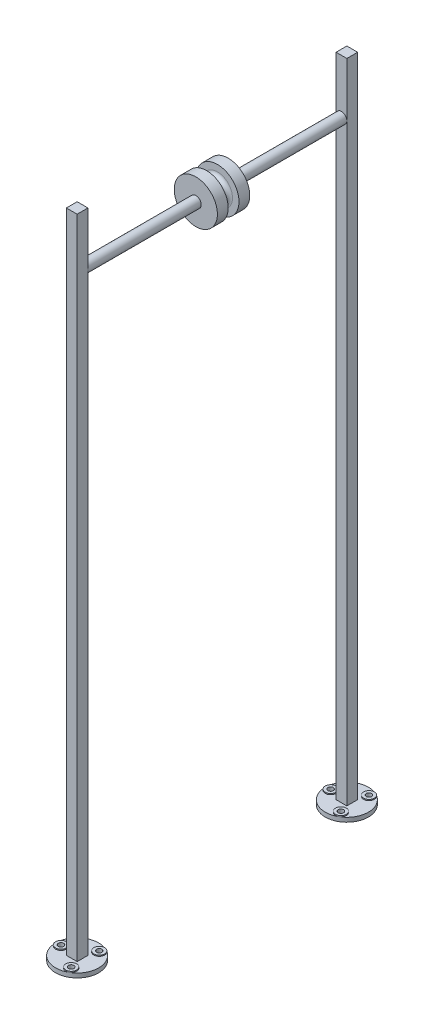
ISO-10303-21;
HEADER;
FILE_DESCRIPTION(('STEP AP214'),'2;1');
FILE_NAME('part.step','',(''),(''),'','','');
FILE_SCHEMA(('AUTOMOTIVE_DESIGN { 1 0 10303 214 1 1 1 1 }'));
ENDSEC;
DATA;
#1=APPLICATION_CONTEXT('core data for automotive mechanical design processes');
#2=APPLICATION_PROTOCOL_DEFINITION('international standard','automotive_design',2000,#1);
#3=PRODUCT_CONTEXT('',#1,'mechanical');
#4=PRODUCT('Part','Part','',(#3));
#5=PRODUCT_RELATED_PRODUCT_CATEGORY('part','',(#4));
#6=PRODUCT_DEFINITION_FORMATION('','',#4);
#7=PRODUCT_DEFINITION_CONTEXT('part definition',#1,'design');
#8=PRODUCT_DEFINITION('design','',#6,#7);
#9=PRODUCT_DEFINITION_SHAPE('','',#8);
#10=(LENGTH_UNIT() NAMED_UNIT(*) SI_UNIT(.MILLI.,.METRE.));
#11=(NAMED_UNIT(*) PLANE_ANGLE_UNIT() SI_UNIT($,.RADIAN.));
#12=(NAMED_UNIT(*) SI_UNIT($,.STERADIAN.) SOLID_ANGLE_UNIT());
#13=UNCERTAINTY_MEASURE_WITH_UNIT(LENGTH_MEASURE(1.E-05),#10,'distance_accuracy_value','');
#14=(GEOMETRIC_REPRESENTATION_CONTEXT(3) GLOBAL_UNCERTAINTY_ASSIGNED_CONTEXT((#13)) GLOBAL_UNIT_ASSIGNED_CONTEXT((#10,
#11,#12)) REPRESENTATION_CONTEXT('',''));
#15=CARTESIAN_POINT('',(0.,0.,0.));
#16=DIRECTION('',(0.,0.,1.));
#17=DIRECTION('',(1.,0.,0.));
#18=AXIS2_PLACEMENT_3D('',#15,#16,#17);
#19=CARTESIAN_POINT('',(0.,10.16,-317.5));
#20=DIRECTION('',(0.,1.,0.));
#21=DIRECTION('',(0.,0.,1.));
#22=AXIS2_PLACEMENT_3D('',#19,#20,#21);
#23=PLANE('',#22);
#24=DIRECTION('',(-1.,0.,0.));
#25=VECTOR('',#24,1.);
#26=CARTESIAN_POINT('',(-12.7,10.16,-330.2));
#27=LINE('',#26,#25);
#28=CARTESIAN_POINT('',(12.7,10.16,-330.2));
#29=VERTEX_POINT('',#28);
#30=CARTESIAN_POINT('',(-12.7,10.16,-330.2));
#31=VERTEX_POINT('',#30);
#32=EDGE_CURVE('E173',#29,#31,#27,.T.);
#33=ORIENTED_EDGE('',*,*,#32,.F.);
#34=DIRECTION('',(0.,0.,-1.));
#35=VECTOR('',#34,1.);
#36=CARTESIAN_POINT('',(12.7,10.16,-330.2));
#37=LINE('',#36,#35);
#38=CARTESIAN_POINT('',(12.7,10.16,-304.8));
#39=VERTEX_POINT('',#38);
#40=EDGE_CURVE('E159',#39,#29,#37,.T.);
#41=ORIENTED_EDGE('',*,*,#40,.F.);
#42=DIRECTION('',(1.,0.,0.));
#43=VECTOR('',#42,1.);
#44=CARTESIAN_POINT('',(-12.7,10.16,-304.8));
#45=LINE('',#44,#43);
#46=CARTESIAN_POINT('',(-12.7,10.16,-304.8));
#47=VERTEX_POINT('',#46);
#48=EDGE_CURVE('E164',#47,#39,#45,.T.);
#49=ORIENTED_EDGE('',*,*,#48,.F.);
#50=DIRECTION('',(0.,0.,1.));
#51=VECTOR('',#50,1.);
#52=CARTESIAN_POINT('',(-12.7,10.16,-330.2));
#53=LINE('',#52,#51);
#54=EDGE_CURVE('E175',#31,#47,#53,.T.);
#55=ORIENTED_EDGE('',*,*,#54,.F.);
#56=EDGE_LOOP('',(#33,#41,#49,#55));
#57=FACE_BOUND('',#56,.T.);
#58=CARTESIAN_POINT('',(0.,10.16,-317.5));
#59=DIRECTION('',(0.,1.,0.));
#60=DIRECTION('',(0.,0.,1.));
#61=AXIS2_PLACEMENT_3D('',#58,#59,#60);
#62=CIRCLE('',#61,50.8);
#63=CARTESIAN_POINT('',(25.4000000000002,10.16,-361.494090512249));
#64=VERTEX_POINT('',#63);
#65=CARTESIAN_POINT('',(-50.8,10.16,-317.5));
#66=VERTEX_POINT('',#65);
#67=EDGE_CURVE('E42',#64,#66,#62,.T.);
#68=ORIENTED_EDGE('',*,*,#67,.T.);
#69=CARTESIAN_POINT('',(-38.1,10.16,-317.5));
#70=DIRECTION('',(0.,1.,0.));
#71=DIRECTION('',(0.,0.,1.));
#72=AXIS2_PLACEMENT_3D('',#69,#70,#71);
#73=CIRCLE('',#72,12.7);
#74=EDGE_CURVE('E47',#66,#66,#73,.T.);
#75=ORIENTED_EDGE('',*,*,#74,.F.);
#76=CARTESIAN_POINT('',(25.3999999999996,10.16,-273.50590948775));
#77=VERTEX_POINT('',#76);
#78=EDGE_CURVE('E53',#66,#77,#62,.T.);
#79=ORIENTED_EDGE('',*,*,#78,.T.);
#80=CARTESIAN_POINT('',(19.0499999999997,10.16,-284.504432115813));
#81=DIRECTION('',(0.,1.,0.));
#82=DIRECTION('',(0.,0.,1.));
#83=AXIS2_PLACEMENT_3D('',#80,#81,#82);
#84=CIRCLE('',#83,12.7000000000001);
#85=EDGE_CURVE('E212',#77,#77,#84,.T.);
#86=ORIENTED_EDGE('',*,*,#85,.F.);
#87=EDGE_CURVE('E203',#77,#64,#62,.T.);
#88=ORIENTED_EDGE('',*,*,#87,.T.);
#89=CARTESIAN_POINT('',(19.0500000000001,10.16,-350.495567884187));
#90=DIRECTION('',(0.,1.,0.));
#91=DIRECTION('',(0.,0.,1.));
#92=AXIS2_PLACEMENT_3D('',#89,#90,#91);
#93=CIRCLE('',#92,12.7);
#94=EDGE_CURVE('E210',#64,#64,#93,.T.);
#95=ORIENTED_EDGE('',*,*,#94,.F.);
#96=EDGE_LOOP('',(#68,#75,#79,#86,#88,#95));
#97=FACE_BOUND('',#96,.T.);
#98=ADVANCED_FACE('F34',(#57,#97),#23,.T.);
#99=CARTESIAN_POINT('',(0.,10.16,317.5));
#100=DIRECTION('',(0.,-1.,0.));
#101=DIRECTION('',(0.,0.,-1.));
#102=AXIS2_PLACEMENT_3D('',#99,#100,#101);
#103=PLANE('',#102);
#104=DIRECTION('',(0.,0.,-1.));
#105=VECTOR('',#104,1.);
#106=CARTESIAN_POINT('',(12.7,10.16,304.8));
#107=LINE('',#106,#105);
#108=CARTESIAN_POINT('',(12.7,10.16,330.2));
#109=VERTEX_POINT('',#108);
#110=CARTESIAN_POINT('',(12.7,10.16,304.8));
#111=VERTEX_POINT('',#110);
#112=EDGE_CURVE('E278',#109,#111,#107,.T.);
#113=ORIENTED_EDGE('',*,*,#112,.F.);
#114=DIRECTION('',(1.,0.,0.));
#115=VECTOR('',#114,1.);
#116=CARTESIAN_POINT('',(-12.7,10.16,330.2));
#117=LINE('',#116,#115);
#118=CARTESIAN_POINT('',(-12.7,10.16,330.2));
#119=VERTEX_POINT('',#118);
#120=EDGE_CURVE('E283',#119,#109,#117,.T.);
#121=ORIENTED_EDGE('',*,*,#120,.F.);
#122=DIRECTION('',(0.,0.,1.));
#123=VECTOR('',#122,1.);
#124=CARTESIAN_POINT('',(-12.7,10.16,304.8));
#125=LINE('',#124,#123);
#126=CARTESIAN_POINT('',(-12.7,10.16,304.8));
#127=VERTEX_POINT('',#126);
#128=EDGE_CURVE('E295',#127,#119,#125,.T.);
#129=ORIENTED_EDGE('',*,*,#128,.F.);
#130=DIRECTION('',(-1.,0.,0.));
#131=VECTOR('',#130,1.);
#132=CARTESIAN_POINT('',(-12.7,10.16,304.8));
#133=LINE('',#132,#131);
#134=EDGE_CURVE('E292',#111,#127,#133,.T.);
#135=ORIENTED_EDGE('',*,*,#134,.F.);
#136=EDGE_LOOP('',(#113,#121,#129,#135));
#137=FACE_BOUND('',#136,.T.);
#138=CARTESIAN_POINT('',(0.,10.16,317.5));
#139=DIRECTION('',(0.,1.,0.));
#140=DIRECTION('',(0.,0.,-1.));
#141=AXIS2_PLACEMENT_3D('',#138,#139,#140);
#142=CIRCLE('',#141,50.8);
#143=CARTESIAN_POINT('',(-50.8,10.16,317.5));
#144=VERTEX_POINT('',#143);
#145=CARTESIAN_POINT('',(25.4000000000002,10.16,361.494090512249));
#146=VERTEX_POINT('',#145);
#147=EDGE_CURVE('E130',#144,#146,#142,.T.);
#148=ORIENTED_EDGE('',*,*,#147,.T.);
#149=CARTESIAN_POINT('',(19.0500000000001,10.16,350.495567884187));
#150=DIRECTION('',(0.,1.,0.));
#151=DIRECTION('',(0.,0.,1.));
#152=AXIS2_PLACEMENT_3D('',#149,#150,#151);
#153=CIRCLE('',#152,12.7);
#154=EDGE_CURVE('E134',#146,#146,#153,.T.);
#155=ORIENTED_EDGE('',*,*,#154,.F.);
#156=CARTESIAN_POINT('',(25.3999999999996,10.16,273.50590948775));
#157=VERTEX_POINT('',#156);
#158=EDGE_CURVE('E140',#146,#157,#142,.T.);
#159=ORIENTED_EDGE('',*,*,#158,.T.);
#160=CARTESIAN_POINT('',(19.0499999999997,10.16,284.504432115813));
#161=DIRECTION('',(0.,1.,0.));
#162=DIRECTION('',(0.,0.,1.));
#163=AXIS2_PLACEMENT_3D('',#160,#161,#162);
#164=CIRCLE('',#163,12.7);
#165=EDGE_CURVE('E235',#157,#157,#164,.T.);
#166=ORIENTED_EDGE('',*,*,#165,.F.);
#167=EDGE_CURVE('E142',#157,#144,#142,.T.);
#168=ORIENTED_EDGE('',*,*,#167,.T.);
#169=CARTESIAN_POINT('',(-38.1,10.16,317.5));
#170=DIRECTION('',(0.,1.,0.));
#171=DIRECTION('',(0.,0.,1.));
#172=AXIS2_PLACEMENT_3D('',#169,#170,#171);
#173=CIRCLE('',#172,12.7);
#174=EDGE_CURVE('E136',#144,#144,#173,.T.);
#175=ORIENTED_EDGE('',*,*,#174,.F.);
#176=EDGE_LOOP('',(#148,#155,#159,#166,#168,#175));
#177=FACE_BOUND('',#176,.T.);
#178=ADVANCED_FACE('F132',(#137,#177),#103,.F.);
#179=CARTESIAN_POINT('',(0.,1407.16,304.8));
#180=DIRECTION('',(0.,0.,-1.));
#181=DIRECTION('',(-1.,0.,0.));
#182=AXIS2_PLACEMENT_3D('',#179,#180,#181);
#183=CYLINDRICAL_SURFACE('',#182,12.7);
#184=CARTESIAN_POINT('',(0.,1407.16,304.8));
#185=DIRECTION('',(0.,0.,-1.));
#186=DIRECTION('',(-1.,0.,0.));
#187=AXIS2_PLACEMENT_3D('',#184,#185,#186);
#188=CIRCLE('',#187,12.7);
#189=CARTESIAN_POINT('',(-12.7,1407.16,304.8));
#190=VERTEX_POINT('',#189);
#191=CARTESIAN_POINT('',(12.7,1407.16,304.8));
#192=VERTEX_POINT('',#191);
#193=EDGE_CURVE('E153',#190,#192,#188,.T.);
#194=ORIENTED_EDGE('',*,*,#193,.T.);
#195=EDGE_CURVE('E139',#192,#190,#188,.T.);
#196=ORIENTED_EDGE('',*,*,#195,.T.);
#197=EDGE_LOOP('',(#194,#196));
#198=FACE_BOUND('',#197,.T.);
#199=CARTESIAN_POINT('',(0.,1407.16,38.1));
#200=DIRECTION('',(0.,0.,1.));
#201=DIRECTION('',(1.,0.,0.));
#202=AXIS2_PLACEMENT_3D('',#199,#200,#201);
#203=CIRCLE('',#202,12.6999999999999);
#204=CARTESIAN_POINT('',(12.6999999999999,1407.16,38.1));
#205=VERTEX_POINT('',#204);
#206=EDGE_CURVE('E275',#205,#205,#203,.T.);
#207=ORIENTED_EDGE('',*,*,#206,.T.);
#208=EDGE_LOOP('',(#207));
#209=FACE_BOUND('',#208,.T.);
#210=ADVANCED_FACE('F354',(#198,#209),#183,.T.);
#211=CARTESIAN_POINT('',(-12.7,1534.16,304.8));
#212=DIRECTION('',(0.,0.,1.));
#213=DIRECTION('',(1.,0.,0.));
#214=AXIS2_PLACEMENT_3D('',#211,#212,#213);
#215=PLANE('',#214);
#216=ORIENTED_EDGE('',*,*,#195,.F.);
#217=DIRECTION('',(0.,-1.,0.));
#218=VECTOR('',#217,1.);
#219=CARTESIAN_POINT('',(12.7,1534.16,304.8));
#220=LINE('',#219,#218);
#221=EDGE_CURVE('E309',#192,#111,#220,.T.);
#222=ORIENTED_EDGE('',*,*,#221,.T.);
#223=ORIENTED_EDGE('',*,*,#134,.T.);
#224=DIRECTION('',(0.,-1.,0.));
#225=VECTOR('',#224,1.);
#226=CARTESIAN_POINT('',(-12.7,1534.16,304.8));
#227=LINE('',#226,#225);
#228=EDGE_CURVE('E305',#190,#127,#227,.T.);
#229=ORIENTED_EDGE('',*,*,#228,.F.);
#230=EDGE_LOOP('',(#216,#222,#223,#229));
#231=FACE_BOUND('',#230,.T.);
#232=ADVANCED_FACE('F446',(#231),#215,.F.);
#233=CARTESIAN_POINT('',(0.,0.,317.5));
#234=DIRECTION('',(0.,-1.,0.));
#235=DIRECTION('',(0.,0.,-1.));
#236=AXIS2_PLACEMENT_3D('',#233,#234,#235);
#237=PLANE('',#236);
#238=CARTESIAN_POINT('',(19.0500000000001,0.,350.495567884187));
#239=DIRECTION('',(0.,1.,0.));
#240=DIRECTION('',(0.,0.,-1.));
#241=AXIS2_PLACEMENT_3D('',#238,#239,#240);
#242=CIRCLE('',#241,6.35);
#243=CARTESIAN_POINT('',(19.0500000000001,0.,344.145567884187));
#244=VERTEX_POINT('',#243);
#245=EDGE_CURVE('E314',#244,#244,#242,.T.);
#246=ORIENTED_EDGE('',*,*,#245,.T.);
#247=EDGE_LOOP('',(#246));
#248=FACE_BOUND('',#247,.T.);
#249=CARTESIAN_POINT('',(0.,0.,317.5));
#250=DIRECTION('',(0.,1.,0.));
#251=DIRECTION('',(0.,0.,-1.));
#252=AXIS2_PLACEMENT_3D('',#249,#250,#251);
#253=CIRCLE('',#252,50.8);
#254=CARTESIAN_POINT('',(0.,0.,266.7));
#255=VERTEX_POINT('',#254);
#256=EDGE_CURVE('E146',#255,#255,#253,.T.);
#257=ORIENTED_EDGE('',*,*,#256,.F.);
#258=EDGE_LOOP('',(#257));
#259=FACE_BOUND('',#258,.T.);
#260=CARTESIAN_POINT('',(19.0499999999997,0.,284.504432115813));
#261=DIRECTION('',(0.,1.,0.));
#262=DIRECTION('',(0.,0.,-1.));
#263=AXIS2_PLACEMENT_3D('',#260,#261,#262);
#264=CIRCLE('',#263,6.35000000000002);
#265=CARTESIAN_POINT('',(19.0499999999997,0.,278.154432115813));
#266=VERTEX_POINT('',#265);
#267=EDGE_CURVE('E149',#266,#266,#264,.T.);
#268=ORIENTED_EDGE('',*,*,#267,.T.);
#269=EDGE_LOOP('',(#268));
#270=FACE_BOUND('',#269,.T.);
#271=CARTESIAN_POINT('',(-38.1,0.,317.5));
#272=DIRECTION('',(0.,1.,0.));
#273=DIRECTION('',(0.,0.,-1.));
#274=AXIS2_PLACEMENT_3D('',#271,#272,#273);
#275=CIRCLE('',#274,6.35);
#276=CARTESIAN_POINT('',(-38.1,0.,311.15));
#277=VERTEX_POINT('',#276);
#278=EDGE_CURVE('E312',#277,#277,#275,.T.);
#279=ORIENTED_EDGE('',*,*,#278,.T.);
#280=EDGE_LOOP('',(#279));
#281=FACE_BOUND('',#280,.T.);
#282=ADVANCED_FACE('F321',(#248,#259,#270,#281),#237,.T.);
#283=CARTESIAN_POINT('',(0.,10.16,317.5));
#284=DIRECTION('',(0.,-1.,0.));
#285=DIRECTION('',(0.,0.,-1.));
#286=AXIS2_PLACEMENT_3D('',#283,#284,#285);
#287=CYLINDRICAL_SURFACE('',#286,50.8);
#288=ORIENTED_EDGE('',*,*,#147,.F.);
#289=ORIENTED_EDGE('',*,*,#167,.F.);
#290=ORIENTED_EDGE('',*,*,#158,.F.);
#291=EDGE_LOOP('',(#288,#289,#290));
#292=FACE_BOUND('',#291,.T.);
#293=ORIENTED_EDGE('',*,*,#256,.T.);
#294=EDGE_LOOP('',(#293));
#295=FACE_BOUND('',#294,.T.);
#296=ADVANCED_FACE('F143',(#292,#295),#287,.T.);
#297=CARTESIAN_POINT('',(19.0499999999997,10.16,284.504432115813));
#298=DIRECTION('',(0.,-1.,0.));
#299=DIRECTION('',(0.,0.,-1.));
#300=AXIS2_PLACEMENT_3D('',#297,#298,#299);
#301=CYLINDRICAL_SURFACE('',#300,6.35000000000002);
#302=ORIENTED_EDGE('',*,*,#267,.F.);
#303=EDGE_LOOP('',(#302));
#304=FACE_BOUND('',#303,.T.);
#305=CARTESIAN_POINT('',(19.0499999999997,12.7,284.504432115813));
#306=DIRECTION('',(0.,1.,0.));
#307=DIRECTION('',(0.,0.,1.));
#308=AXIS2_PLACEMENT_3D('',#305,#306,#307);
#309=CIRCLE('',#308,6.35000000000001);
#310=CARTESIAN_POINT('',(19.0499999999997,12.7,290.854432115813));
#311=VERTEX_POINT('',#310);
#312=EDGE_CURVE('E231',#311,#311,#309,.T.);
#313=ORIENTED_EDGE('',*,*,#312,.T.);
#314=EDGE_LOOP('',(#313));
#315=FACE_BOUND('',#314,.T.);
#316=ADVANCED_FACE('F324',(#304,#315),#301,.F.);
#317=CARTESIAN_POINT('',(19.0500000000001,10.16,350.495567884187));
#318=DIRECTION('',(0.,-1.,0.));
#319=DIRECTION('',(0.,0.,-1.));
#320=AXIS2_PLACEMENT_3D('',#317,#318,#319);
#321=CYLINDRICAL_SURFACE('',#320,6.35);
#322=ORIENTED_EDGE('',*,*,#245,.F.);
#323=EDGE_LOOP('',(#322));
#324=FACE_BOUND('',#323,.T.);
#325=CARTESIAN_POINT('',(19.0500000000001,12.7,350.495567884187));
#326=DIRECTION('',(0.,1.,0.));
#327=DIRECTION('',(0.,0.,1.));
#328=AXIS2_PLACEMENT_3D('',#325,#326,#327);
#329=CIRCLE('',#328,6.35000000000001);
#330=CARTESIAN_POINT('',(19.0500000000001,12.7,356.845567884187));
#331=VERTEX_POINT('',#330);
#332=EDGE_CURVE('E220',#331,#331,#329,.T.);
#333=ORIENTED_EDGE('',*,*,#332,.T.);
#334=EDGE_LOOP('',(#333));
#335=FACE_BOUND('',#334,.T.);
#336=ADVANCED_FACE('F327',(#324,#335),#321,.F.);
#337=CARTESIAN_POINT('',(-38.1,10.16,317.5));
#338=DIRECTION('',(0.,-1.,0.));
#339=DIRECTION('',(0.,0.,-1.));
#340=AXIS2_PLACEMENT_3D('',#337,#338,#339);
#341=CYLINDRICAL_SURFACE('',#340,6.35);
#342=ORIENTED_EDGE('',*,*,#278,.F.);
#343=EDGE_LOOP('',(#342));
#344=FACE_BOUND('',#343,.T.);
#345=CARTESIAN_POINT('',(-38.1,12.7,317.5));
#346=DIRECTION('',(0.,1.,0.));
#347=DIRECTION('',(0.,0.,1.));
#348=AXIS2_PLACEMENT_3D('',#345,#346,#347);
#349=CIRCLE('',#348,6.35000000000002);
#350=CARTESIAN_POINT('',(-38.1,12.7,323.85));
#351=VERTEX_POINT('',#350);
#352=EDGE_CURVE('E239',#351,#351,#349,.T.);
#353=ORIENTED_EDGE('',*,*,#352,.T.);
#354=EDGE_LOOP('',(#353));
#355=FACE_BOUND('',#354,.T.);
#356=ADVANCED_FACE('F433',(#344,#355),#341,.F.);
#357=CARTESIAN_POINT('',(12.7,1534.16,304.8));
#358=DIRECTION('',(-1.,0.,0.));
#359=DIRECTION('',(0.,0.,1.));
#360=AXIS2_PLACEMENT_3D('',#357,#358,#359);
#361=PLANE('',#360);
#362=ORIENTED_EDGE('',*,*,#112,.T.);
#363=ORIENTED_EDGE('',*,*,#221,.F.);
#364=CARTESIAN_POINT('',(12.7,1534.16,304.8));
#365=VERTEX_POINT('',#364);
#366=EDGE_CURVE('E310',#365,#192,#220,.T.);
#367=ORIENTED_EDGE('',*,*,#366,.F.);
#368=DIRECTION('',(0.,0.,-1.));
#369=VECTOR('',#368,1.);
#370=CARTESIAN_POINT('',(12.7,1534.16,304.8));
#371=LINE('',#370,#369);
#372=CARTESIAN_POINT('',(12.7,1534.16,330.2));
#373=VERTEX_POINT('',#372);
#374=EDGE_CURVE('E279',#373,#365,#371,.T.);
#375=ORIENTED_EDGE('',*,*,#374,.F.);
#376=DIRECTION('',(0.,-1.,0.));
#377=VECTOR('',#376,1.);
#378=CARTESIAN_POINT('',(12.7,1534.16,330.2));
#379=LINE('',#378,#377);
#380=EDGE_CURVE('E289',#373,#109,#379,.T.);
#381=ORIENTED_EDGE('',*,*,#380,.T.);
#382=EDGE_LOOP('',(#362,#363,#367,#375,#381));
#383=FACE_BOUND('',#382,.T.);
#384=ADVANCED_FACE('F439',(#383),#361,.F.);
#385=ORIENTED_EDGE('',*,*,#193,.F.);
#386=CARTESIAN_POINT('',(-12.7,1534.16,304.8));
#387=VERTEX_POINT('',#386);
#388=EDGE_CURVE('E306',#387,#190,#227,.T.);
#389=ORIENTED_EDGE('',*,*,#388,.F.);
#390=DIRECTION('',(-1.,0.,0.));
#391=VECTOR('',#390,1.);
#392=CARTESIAN_POINT('',(-12.7,1534.16,304.8));
#393=LINE('',#392,#391);
#394=EDGE_CURVE('E282',#365,#387,#393,.T.);
#395=ORIENTED_EDGE('',*,*,#394,.F.);
#396=ORIENTED_EDGE('',*,*,#366,.T.);
#397=EDGE_LOOP('',(#385,#389,#395,#396));
#398=FACE_BOUND('',#397,.T.);
#399=ADVANCED_FACE('F668',(#398),#215,.F.);
#400=CARTESIAN_POINT('',(-12.7,1534.16,304.8));
#401=DIRECTION('',(1.,0.,0.));
#402=DIRECTION('',(0.,0.,-1.));
#403=AXIS2_PLACEMENT_3D('',#400,#401,#402);
#404=PLANE('',#403);
#405=ORIENTED_EDGE('',*,*,#128,.T.);
#406=DIRECTION('',(0.,-1.,0.));
#407=VECTOR('',#406,1.);
#408=CARTESIAN_POINT('',(-12.7,1534.16,330.2));
#409=LINE('',#408,#407);
#410=CARTESIAN_POINT('',(-12.7,1534.16,330.2));
#411=VERTEX_POINT('',#410);
#412=EDGE_CURVE('E302',#411,#119,#409,.T.);
#413=ORIENTED_EDGE('',*,*,#412,.F.);
#414=DIRECTION('',(0.,0.,1.));
#415=VECTOR('',#414,1.);
#416=CARTESIAN_POINT('',(-12.7,1534.16,304.8));
#417=LINE('',#416,#415);
#418=EDGE_CURVE('E285',#387,#411,#417,.T.);
#419=ORIENTED_EDGE('',*,*,#418,.F.);
#420=ORIENTED_EDGE('',*,*,#388,.T.);
#421=ORIENTED_EDGE('',*,*,#228,.T.);
#422=EDGE_LOOP('',(#405,#413,#419,#420,#421));
#423=FACE_BOUND('',#422,.T.);
#424=ADVANCED_FACE('F658',(#423),#404,.F.);
#425=CARTESIAN_POINT('',(-12.7,1534.16,330.2));
#426=DIRECTION('',(0.,0.,-1.));
#427=DIRECTION('',(-1.,0.,0.));
#428=AXIS2_PLACEMENT_3D('',#425,#426,#427);
#429=PLANE('',#428);
#430=ORIENTED_EDGE('',*,*,#120,.T.);
#431=ORIENTED_EDGE('',*,*,#380,.F.);
#432=DIRECTION('',(1.,0.,0.));
#433=VECTOR('',#432,1.);
#434=CARTESIAN_POINT('',(-12.7,1534.16,330.2));
#435=LINE('',#434,#433);
#436=EDGE_CURVE('E287',#411,#373,#435,.T.);
#437=ORIENTED_EDGE('',*,*,#436,.F.);
#438=ORIENTED_EDGE('',*,*,#412,.T.);
#439=EDGE_LOOP('',(#430,#431,#437,#438));
#440=FACE_BOUND('',#439,.T.);
#441=ADVANCED_FACE('F648',(#440),#429,.F.);
#442=CARTESIAN_POINT('',(0.,1534.16,0.));
#443=DIRECTION('',(0.,1.,0.));
#444=DIRECTION('',(0.,0.,1.));
#445=AXIS2_PLACEMENT_3D('',#442,#443,#444);
#446=PLANE('',#445);
#447=ORIENTED_EDGE('',*,*,#374,.T.);
#448=ORIENTED_EDGE('',*,*,#394,.T.);
#449=ORIENTED_EDGE('',*,*,#418,.T.);
#450=ORIENTED_EDGE('',*,*,#436,.T.);
#451=EDGE_LOOP('',(#447,#448,#449,#450));
#452=FACE_BOUND('',#451,.T.);
#453=ADVANCED_FACE('F633',(#452),#446,.T.);
#454=CARTESIAN_POINT('',(0.,1419.86,38.1));
#455=DIRECTION('',(0.,0.,-1.));
#456=DIRECTION('',(-1.,0.,0.));
#457=AXIS2_PLACEMENT_3D('',#454,#455,#456);
#458=PLANE('',#457);
#459=ORIENTED_EDGE('',*,*,#206,.F.);
#460=EDGE_LOOP('',(#459));
#461=FACE_BOUND('',#460,.T.);
#462=CARTESIAN_POINT('',(0.,1407.16,38.1));
#463=DIRECTION('',(0.,0.,1.));
#464=DIRECTION('',(1.,0.,0.));
#465=AXIS2_PLACEMENT_3D('',#462,#463,#464);
#466=CIRCLE('',#465,50.8);
#467=CARTESIAN_POINT('',(50.8,1407.16,38.1));
#468=VERTEX_POINT('',#467);
#469=EDGE_CURVE('E272',#468,#468,#466,.T.);
#470=ORIENTED_EDGE('',*,*,#469,.T.);
#471=EDGE_LOOP('',(#470));
#472=FACE_BOUND('',#471,.T.);
#473=ADVANCED_FACE('F623',(#461,#472),#458,.F.);
#474=CARTESIAN_POINT('',(0.,1407.16,304.8));
#475=DIRECTION('',(0.,0.,1.));
#476=DIRECTION('',(1.,0.,0.));
#477=AXIS2_PLACEMENT_3D('',#474,#475,#476);
#478=CYLINDRICAL_SURFACE('',#477,50.8);
#479=ORIENTED_EDGE('',*,*,#469,.F.);
#480=EDGE_LOOP('',(#479));
#481=FACE_BOUND('',#480,.T.);
#482=CARTESIAN_POINT('',(0.,1407.16,12.7));
#483=DIRECTION('',(0.,0.,1.));
#484=DIRECTION('',(1.,0.,0.));
#485=AXIS2_PLACEMENT_3D('',#482,#483,#484);
#486=CIRCLE('',#485,50.8);
#487=CARTESIAN_POINT('',(50.8,1407.16,12.7));
#488=VERTEX_POINT('',#487);
#489=EDGE_CURVE('E269',#488,#488,#486,.T.);
#490=ORIENTED_EDGE('',*,*,#489,.T.);
#491=EDGE_LOOP('',(#490));
#492=FACE_BOUND('',#491,.T.);
#493=ADVANCED_FACE('F613',(#481,#492),#478,.T.);
#494=CARTESIAN_POINT('',(0.,1457.96,12.7));
#495=DIRECTION('',(0.,0.,1.));
#496=DIRECTION('',(1.,0.,0.));
#497=AXIS2_PLACEMENT_3D('',#494,#495,#496);
#498=PLANE('',#497);
#499=ORIENTED_EDGE('',*,*,#489,.F.);
#500=EDGE_LOOP('',(#499));
#501=FACE_BOUND('',#500,.T.);
#502=CARTESIAN_POINT('',(0.,1407.16,12.7));
#503=DIRECTION('',(0.,0.,1.));
#504=DIRECTION('',(1.,0.,0.));
#505=AXIS2_PLACEMENT_3D('',#502,#503,#504);
#506=CIRCLE('',#505,35.5599999999998);
#507=CARTESIAN_POINT('',(35.5599999999998,1407.16,12.7));
#508=VERTEX_POINT('',#507);
#509=EDGE_CURVE('E266',#508,#508,#506,.T.);
#510=ORIENTED_EDGE('',*,*,#509,.T.);
#511=EDGE_LOOP('',(#510));
#512=FACE_BOUND('',#511,.T.);
#513=ADVANCED_FACE('F603',(#501,#512),#498,.F.);
#514=CARTESIAN_POINT('',(0.,1407.16,2.53999999999999));
#515=DIRECTION('',(0.,0.,1.));
#516=DIRECTION('',(1.,0.,0.));
#517=AXIS2_PLACEMENT_3D('',#514,#515,#516);
#518=TOROIDAL_SURFACE('',#517,35.5599999999998,10.16);
#519=ORIENTED_EDGE('',*,*,#509,.F.);
#520=EDGE_LOOP('',(#519));
#521=FACE_BOUND('',#520,.T.);
#522=CARTESIAN_POINT('',(0.,1407.16,2.53999999999999));
#523=DIRECTION('',(0.,0.,1.));
#524=DIRECTION('',(1.,0.,0.));
#525=AXIS2_PLACEMENT_3D('',#522,#523,#524);
#526=CIRCLE('',#525,25.3999999999999);
#527=CARTESIAN_POINT('',(25.3999999999999,1407.16,2.53999999999999));
#528=VERTEX_POINT('',#527);
#529=EDGE_CURVE('E263',#528,#528,#526,.T.);
#530=ORIENTED_EDGE('',*,*,#529,.T.);
#531=EDGE_LOOP('',(#530));
#532=FACE_BOUND('',#531,.T.);
#533=ADVANCED_FACE('F593',(#521,#532),#518,.F.);
#534=CARTESIAN_POINT('',(0.,1407.16,304.8));
#535=DIRECTION('',(0.,0.,1.));
#536=DIRECTION('',(1.,0.,0.));
#537=AXIS2_PLACEMENT_3D('',#534,#535,#536);
#538=CYLINDRICAL_SURFACE('',#537,25.3999999999999);
#539=ORIENTED_EDGE('',*,*,#529,.F.);
#540=EDGE_LOOP('',(#539));
#541=FACE_BOUND('',#540,.T.);
#542=CARTESIAN_POINT('',(0.,1407.16,-2.53999999999988));
#543=DIRECTION('',(0.,0.,1.));
#544=DIRECTION('',(1.,0.,0.));
#545=AXIS2_PLACEMENT_3D('',#542,#543,#544);
#546=CIRCLE('',#545,25.3999999999999);
#547=CARTESIAN_POINT('',(25.3999999999999,1407.16,-2.53999999999988));
#548=VERTEX_POINT('',#547);
#549=EDGE_CURVE('E260',#548,#548,#546,.T.);
#550=ORIENTED_EDGE('',*,*,#549,.T.);
#551=EDGE_LOOP('',(#550));
#552=FACE_BOUND('',#551,.T.);
#553=ADVANCED_FACE('F583',(#541,#552),#538,.T.);
#554=CARTESIAN_POINT('',(0.,1407.16,-2.53999999999984));
#555=DIRECTION('',(0.,0.,1.));
#556=DIRECTION('',(1.,0.,0.));
#557=AXIS2_PLACEMENT_3D('',#554,#555,#556);
#558=TOROIDAL_SURFACE('',#557,35.5599999999998,10.16);
#559=ORIENTED_EDGE('',*,*,#549,.F.);
#560=EDGE_LOOP('',(#559));
#561=FACE_BOUND('',#560,.T.);
#562=CARTESIAN_POINT('',(0.,1407.16,-12.6999999999998));
#563=DIRECTION('',(0.,0.,1.));
#564=DIRECTION('',(1.,0.,0.));
#565=AXIS2_PLACEMENT_3D('',#562,#563,#564);
#566=CIRCLE('',#565,35.5599999999998);
#567=CARTESIAN_POINT('',(35.5599999999998,1407.16,-12.6999999999998));
#568=VERTEX_POINT('',#567);
#569=EDGE_CURVE('E257',#568,#568,#566,.T.);
#570=ORIENTED_EDGE('',*,*,#569,.T.);
#571=EDGE_LOOP('',(#570));
#572=FACE_BOUND('',#571,.T.);
#573=ADVANCED_FACE('F573',(#561,#572),#558,.F.);
#574=CARTESIAN_POINT('',(0.,1457.96,-12.6999999999998));
#575=DIRECTION('',(0.,0.,-1.));
#576=DIRECTION('',(-1.,0.,0.));
#577=AXIS2_PLACEMENT_3D('',#574,#575,#576);
#578=PLANE('',#577);
#579=ORIENTED_EDGE('',*,*,#569,.F.);
#580=EDGE_LOOP('',(#579));
#581=FACE_BOUND('',#580,.T.);
#582=CARTESIAN_POINT('',(0.,1407.16,-12.6999999999998));
#583=DIRECTION('',(0.,0.,1.));
#584=DIRECTION('',(1.,0.,0.));
#585=AXIS2_PLACEMENT_3D('',#582,#583,#584);
#586=CIRCLE('',#585,50.8);
#587=CARTESIAN_POINT('',(50.8,1407.16,-12.6999999999998));
#588=VERTEX_POINT('',#587);
#589=EDGE_CURVE('E254',#588,#588,#586,.T.);
#590=ORIENTED_EDGE('',*,*,#589,.T.);
#591=EDGE_LOOP('',(#590));
#592=FACE_BOUND('',#591,.T.);
#593=ADVANCED_FACE('F563',(#581,#592),#578,.F.);
#594=CARTESIAN_POINT('',(0.,1407.16,304.8));
#595=DIRECTION('',(0.,0.,1.));
#596=DIRECTION('',(1.,0.,0.));
#597=AXIS2_PLACEMENT_3D('',#594,#595,#596);
#598=CYLINDRICAL_SURFACE('',#597,50.8);
#599=ORIENTED_EDGE('',*,*,#589,.F.);
#600=EDGE_LOOP('',(#599));
#601=FACE_BOUND('',#600,.T.);
#602=CARTESIAN_POINT('',(0.,1407.16,-38.0999999999998));
#603=DIRECTION('',(0.,0.,1.));
#604=DIRECTION('',(1.,0.,0.));
#605=AXIS2_PLACEMENT_3D('',#602,#603,#604);
#606=CIRCLE('',#605,50.8);
#607=CARTESIAN_POINT('',(50.8,1407.16,-38.0999999999998));
#608=VERTEX_POINT('',#607);
#609=EDGE_CURVE('E251',#608,#608,#606,.T.);
#610=ORIENTED_EDGE('',*,*,#609,.T.);
#611=EDGE_LOOP('',(#610));
#612=FACE_BOUND('',#611,.T.);
#613=ADVANCED_FACE('F372',(#601,#612),#598,.T.);
#614=CARTESIAN_POINT('',(0.,1419.86,-38.0999999999998));
#615=DIRECTION('',(0.,0.,1.));
#616=DIRECTION('',(1.,0.,0.));
#617=AXIS2_PLACEMENT_3D('',#614,#615,#616);
#618=PLANE('',#617);
#619=ORIENTED_EDGE('',*,*,#609,.F.);
#620=EDGE_LOOP('',(#619));
#621=FACE_BOUND('',#620,.T.);
#622=CARTESIAN_POINT('',(0.,1407.16,-38.0999999999999));
#623=DIRECTION('',(0.,0.,1.));
#624=DIRECTION('',(1.,0.,0.));
#625=AXIS2_PLACEMENT_3D('',#622,#623,#624);
#626=CIRCLE('',#625,12.6999999999999);
#627=CARTESIAN_POINT('',(12.6999999999999,1407.16,-38.0999999999999));
#628=VERTEX_POINT('',#627);
#629=EDGE_CURVE('E247',#628,#628,#626,.T.);
#630=ORIENTED_EDGE('',*,*,#629,.T.);
#631=EDGE_LOOP('',(#630));
#632=FACE_BOUND('',#631,.T.);
#633=ADVANCED_FACE('F364',(#621,#632),#618,.F.);
#634=CARTESIAN_POINT('',(0.,0.,-317.5));
#635=DIRECTION('',(0.,1.,0.));
#636=DIRECTION('',(0.,0.,1.));
#637=AXIS2_PLACEMENT_3D('',#634,#635,#636);
#638=PLANE('',#637);
#639=CARTESIAN_POINT('',(0.,0.,-317.5));
#640=DIRECTION('',(0.,1.,0.));
#641=DIRECTION('',(0.,0.,1.));
#642=AXIS2_PLACEMENT_3D('',#639,#640,#641);
#643=CIRCLE('',#642,50.8);
#644=CARTESIAN_POINT('',(0.,0.,-266.7));
#645=VERTEX_POINT('',#644);
#646=EDGE_CURVE('E201',#645,#645,#643,.T.);
#647=ORIENTED_EDGE('',*,*,#646,.F.);
#648=EDGE_LOOP('',(#647));
#649=FACE_BOUND('',#648,.T.);
#650=CARTESIAN_POINT('',(-38.1,0.,-317.5));
#651=DIRECTION('',(0.,1.,0.));
#652=DIRECTION('',(0.,0.,1.));
#653=AXIS2_PLACEMENT_3D('',#650,#651,#652);
#654=CIRCLE('',#653,6.35);
#655=CARTESIAN_POINT('',(-38.1,0.,-311.15));
#656=VERTEX_POINT('',#655);
#657=EDGE_CURVE('E198',#656,#656,#654,.T.);
#658=ORIENTED_EDGE('',*,*,#657,.T.);
#659=EDGE_LOOP('',(#658));
#660=FACE_BOUND('',#659,.T.);
#661=CARTESIAN_POINT('',(19.0500000000001,0.,-350.495567884187));
#662=DIRECTION('',(0.,1.,0.));
#663=DIRECTION('',(0.,0.,1.));
#664=AXIS2_PLACEMENT_3D('',#661,#662,#663);
#665=CIRCLE('',#664,6.35);
#666=CARTESIAN_POINT('',(19.0500000000001,0.,-344.145567884187));
#667=VERTEX_POINT('',#666);
#668=EDGE_CURVE('E195',#667,#667,#665,.T.);
#669=ORIENTED_EDGE('',*,*,#668,.T.);
#670=EDGE_LOOP('',(#669));
#671=FACE_BOUND('',#670,.T.);
#672=CARTESIAN_POINT('',(19.0499999999997,0.,-284.504432115813));
#673=DIRECTION('',(0.,1.,0.));
#674=DIRECTION('',(0.,0.,1.));
#675=AXIS2_PLACEMENT_3D('',#672,#673,#674);
#676=CIRCLE('',#675,6.35000000000002);
#677=CARTESIAN_POINT('',(19.0499999999997,0.,-278.154432115813));
#678=VERTEX_POINT('',#677);
#679=EDGE_CURVE('E192',#678,#678,#676,.T.);
#680=ORIENTED_EDGE('',*,*,#679,.T.);
#681=EDGE_LOOP('',(#680));
#682=FACE_BOUND('',#681,.T.);
#683=ADVANCED_FACE('F361',(#649,#660,#671,#682),#638,.F.);
#684=CARTESIAN_POINT('',(19.0499999999997,10.16,-284.504432115813));
#685=DIRECTION('',(0.,-1.,0.));
#686=DIRECTION('',(0.,0.,-1.));
#687=AXIS2_PLACEMENT_3D('',#684,#685,#686);
#688=CYLINDRICAL_SURFACE('',#687,6.35000000000002);
#689=ORIENTED_EDGE('',*,*,#679,.F.);
#690=EDGE_LOOP('',(#689));
#691=FACE_BOUND('',#690,.T.);
#692=CARTESIAN_POINT('',(19.0499999999997,12.7,-284.504432115813));
#693=DIRECTION('',(0.,1.,0.));
#694=DIRECTION('',(0.,0.,1.));
#695=AXIS2_PLACEMENT_3D('',#692,#693,#694);
#696=CIRCLE('',#695,6.35000000000003);
#697=CARTESIAN_POINT('',(19.0499999999997,12.7,-278.154432115813));
#698=VERTEX_POINT('',#697);
#699=EDGE_CURVE('E384',#698,#698,#696,.T.);
#700=ORIENTED_EDGE('',*,*,#699,.T.);
#701=EDGE_LOOP('',(#700));
#702=FACE_BOUND('',#701,.T.);
#703=ADVANCED_FACE('F363',(#691,#702),#688,.F.);
#704=CARTESIAN_POINT('',(-38.1,10.16,-317.5));
#705=DIRECTION('',(0.,-1.,0.));
#706=DIRECTION('',(0.,0.,-1.));
#707=AXIS2_PLACEMENT_3D('',#704,#705,#706);
#708=CYLINDRICAL_SURFACE('',#707,6.35);
#709=ORIENTED_EDGE('',*,*,#657,.F.);
#710=EDGE_LOOP('',(#709));
#711=FACE_BOUND('',#710,.T.);
#712=CARTESIAN_POINT('',(-38.1,12.7,-317.5));
#713=DIRECTION('',(0.,1.,0.));
#714=DIRECTION('',(0.,0.,1.));
#715=AXIS2_PLACEMENT_3D('',#712,#713,#714);
#716=CIRCLE('',#715,6.35000000000002);
#717=CARTESIAN_POINT('',(-38.1,12.7,-311.15));
#718=VERTEX_POINT('',#717);
#719=EDGE_CURVE('E486',#718,#718,#716,.T.);
#720=ORIENTED_EDGE('',*,*,#719,.T.);
#721=EDGE_LOOP('',(#720));
#722=FACE_BOUND('',#721,.T.);
#723=ADVANCED_FACE('F359',(#711,#722),#708,.F.);
#724=CARTESIAN_POINT('',(0.,10.16,-317.5));
#725=DIRECTION('',(0.,-1.,0.));
#726=DIRECTION('',(0.,0.,-1.));
#727=AXIS2_PLACEMENT_3D('',#724,#725,#726);
#728=CYLINDRICAL_SURFACE('',#727,50.8);
#729=ORIENTED_EDGE('',*,*,#67,.F.);
#730=ORIENTED_EDGE('',*,*,#87,.F.);
#731=ORIENTED_EDGE('',*,*,#78,.F.);
#732=EDGE_LOOP('',(#729,#730,#731));
#733=FACE_BOUND('',#732,.T.);
#734=ORIENTED_EDGE('',*,*,#646,.T.);
#735=EDGE_LOOP('',(#734));
#736=FACE_BOUND('',#735,.T.);
#737=ADVANCED_FACE('F36',(#733,#736),#728,.T.);
#738=CARTESIAN_POINT('',(19.0500000000001,10.16,-350.495567884187));
#739=DIRECTION('',(0.,-1.,0.));
#740=DIRECTION('',(0.,0.,-1.));
#741=AXIS2_PLACEMENT_3D('',#738,#739,#740);
#742=CYLINDRICAL_SURFACE('',#741,6.35);
#743=ORIENTED_EDGE('',*,*,#668,.F.);
#744=EDGE_LOOP('',(#743));
#745=FACE_BOUND('',#744,.T.);
#746=CARTESIAN_POINT('',(19.0500000000001,12.7,-350.495567884187));
#747=DIRECTION('',(0.,1.,0.));
#748=DIRECTION('',(0.,0.,1.));
#749=AXIS2_PLACEMENT_3D('',#746,#747,#748);
#750=CIRCLE('',#749,6.35000000000002);
#751=CARTESIAN_POINT('',(19.0500000000001,12.7,-344.145567884187));
#752=VERTEX_POINT('',#751);
#753=EDGE_CURVE('E217',#752,#752,#750,.T.);
#754=ORIENTED_EDGE('',*,*,#753,.T.);
#755=EDGE_LOOP('',(#754));
#756=FACE_BOUND('',#755,.T.);
#757=ADVANCED_FACE('F470',(#745,#756),#742,.F.);
#758=CARTESIAN_POINT('',(-12.7,1534.16,-330.2));
#759=DIRECTION('',(0.,0.,1.));
#760=DIRECTION('',(1.,0.,0.));
#761=AXIS2_PLACEMENT_3D('',#758,#759,#760);
#762=PLANE('',#761);
#763=ORIENTED_EDGE('',*,*,#32,.T.);
#764=DIRECTION('',(0.,-1.,0.));
#765=VECTOR('',#764,1.);
#766=CARTESIAN_POINT('',(-12.7,1534.16,-330.2));
#767=LINE('',#766,#765);
#768=CARTESIAN_POINT('',(-12.7,1534.16,-330.2));
#769=VERTEX_POINT('',#768);
#770=EDGE_CURVE('E187',#769,#31,#767,.T.);
#771=ORIENTED_EDGE('',*,*,#770,.F.);
#772=DIRECTION('',(-1.,0.,0.));
#773=VECTOR('',#772,1.);
#774=CARTESIAN_POINT('',(-12.7,1534.16,-330.2));
#775=LINE('',#774,#773);
#776=CARTESIAN_POINT('',(12.7,1534.16,-330.2));
#777=VERTEX_POINT('',#776);
#778=EDGE_CURVE('E163',#777,#769,#775,.T.);
#779=ORIENTED_EDGE('',*,*,#778,.F.);
#780=DIRECTION('',(0.,-1.,0.));
#781=VECTOR('',#780,1.);
#782=CARTESIAN_POINT('',(12.7,1534.16,-330.2));
#783=LINE('',#782,#781);
#784=EDGE_CURVE('E190',#777,#29,#783,.T.);
#785=ORIENTED_EDGE('',*,*,#784,.T.);
#786=EDGE_LOOP('',(#763,#771,#779,#785));
#787=FACE_BOUND('',#786,.T.);
#788=ADVANCED_FACE('F457',(#787),#762,.F.);
#789=CARTESIAN_POINT('',(0.,1534.16,0.));
#790=DIRECTION('',(0.,1.,0.));
#791=DIRECTION('',(0.,0.,1.));
#792=AXIS2_PLACEMENT_3D('',#789,#790,#791);
#793=PLANE('',#792);
#794=DIRECTION('',(0.,0.,-1.));
#795=VECTOR('',#794,1.);
#796=CARTESIAN_POINT('',(12.7,1534.16,-330.2));
#797=LINE('',#796,#795);
#798=CARTESIAN_POINT('',(12.7,1534.16,-304.8));
#799=VERTEX_POINT('',#798);
#800=EDGE_CURVE('E160',#799,#777,#797,.T.);
#801=ORIENTED_EDGE('',*,*,#800,.T.);
#802=ORIENTED_EDGE('',*,*,#778,.T.);
#803=DIRECTION('',(0.,0.,1.));
#804=VECTOR('',#803,1.);
#805=CARTESIAN_POINT('',(-12.7,1534.16,-330.2));
#806=LINE('',#805,#804);
#807=CARTESIAN_POINT('',(-12.7,1534.16,-304.8));
#808=VERTEX_POINT('',#807);
#809=EDGE_CURVE('E166',#769,#808,#806,.T.);
#810=ORIENTED_EDGE('',*,*,#809,.T.);
#811=DIRECTION('',(1.,0.,0.));
#812=VECTOR('',#811,1.);
#813=CARTESIAN_POINT('',(-12.7,1534.16,-304.8));
#814=LINE('',#813,#812);
#815=EDGE_CURVE('E168',#808,#799,#814,.T.);
#816=ORIENTED_EDGE('',*,*,#815,.T.);
#817=EDGE_LOOP('',(#801,#802,#810,#816));
#818=FACE_BOUND('',#817,.T.);
#819=ADVANCED_FACE('F453',(#818),#793,.T.);
#820=CARTESIAN_POINT('',(12.7,1534.16,-330.2));
#821=DIRECTION('',(-1.,0.,0.));
#822=DIRECTION('',(0.,0.,1.));
#823=AXIS2_PLACEMENT_3D('',#820,#821,#822);
#824=PLANE('',#823);
#825=ORIENTED_EDGE('',*,*,#40,.T.);
#826=ORIENTED_EDGE('',*,*,#784,.F.);
#827=ORIENTED_EDGE('',*,*,#800,.F.);
#828=DIRECTION('',(0.,-1.,0.));
#829=VECTOR('',#828,1.);
#830=CARTESIAN_POINT('',(12.7,1534.16,-304.8));
#831=LINE('',#830,#829);
#832=CARTESIAN_POINT('',(12.7,1407.16,-304.8));
#833=VERTEX_POINT('',#832);
#834=EDGE_CURVE('E180',#799,#833,#831,.T.);
#835=ORIENTED_EDGE('',*,*,#834,.T.);
#836=EDGE_CURVE('E170',#833,#39,#831,.T.);
#837=ORIENTED_EDGE('',*,*,#836,.T.);
#838=EDGE_LOOP('',(#825,#826,#827,#835,#837));
#839=FACE_BOUND('',#838,.T.);
#840=ADVANCED_FACE('F456',(#839),#824,.F.);
#841=CARTESIAN_POINT('',(-12.7,1534.16,-330.2));
#842=DIRECTION('',(1.,0.,0.));
#843=DIRECTION('',(0.,0.,-1.));
#844=AXIS2_PLACEMENT_3D('',#841,#842,#843);
#845=PLANE('',#844);
#846=ORIENTED_EDGE('',*,*,#54,.T.);
#847=DIRECTION('',(0.,-1.,0.));
#848=VECTOR('',#847,1.);
#849=CARTESIAN_POINT('',(-12.7,1534.16,-304.8));
#850=LINE('',#849,#848);
#851=CARTESIAN_POINT('',(-12.7,1407.16,-304.8));
#852=VERTEX_POINT('',#851);
#853=EDGE_CURVE('E183',#852,#47,#850,.T.);
#854=ORIENTED_EDGE('',*,*,#853,.F.);
#855=EDGE_CURVE('E184',#808,#852,#850,.T.);
#856=ORIENTED_EDGE('',*,*,#855,.F.);
#857=ORIENTED_EDGE('',*,*,#809,.F.);
#858=ORIENTED_EDGE('',*,*,#770,.T.);
#859=EDGE_LOOP('',(#846,#854,#856,#857,#858));
#860=FACE_BOUND('',#859,.T.);
#861=ADVANCED_FACE('F463',(#860),#845,.F.);
#862=CARTESIAN_POINT('',(-12.7,1534.16,-304.8));
#863=DIRECTION('',(0.,0.,-1.));
#864=DIRECTION('',(-1.,0.,0.));
#865=AXIS2_PLACEMENT_3D('',#862,#863,#864);
#866=PLANE('',#865);
#867=ORIENTED_EDGE('',*,*,#836,.F.);
#868=CARTESIAN_POINT('',(0.,1407.16,-304.8));
#869=DIRECTION('',(0.,0.,-1.));
#870=DIRECTION('',(-1.,0.,0.));
#871=AXIS2_PLACEMENT_3D('',#868,#869,#870);
#872=CIRCLE('',#871,12.7);
#873=EDGE_CURVE('E11',#833,#852,#872,.T.);
#874=ORIENTED_EDGE('',*,*,#873,.T.);
#875=ORIENTED_EDGE('',*,*,#853,.T.);
#876=ORIENTED_EDGE('',*,*,#48,.T.);
#877=EDGE_LOOP('',(#867,#874,#875,#876));
#878=FACE_BOUND('',#877,.T.);
#879=ADVANCED_FACE('F459',(#878),#866,.F.);
#880=ORIENTED_EDGE('',*,*,#855,.T.);
#881=CARTESIAN_POINT('',(0.,1407.16,-304.8));
#882=DIRECTION('',(0.,0.,-1.));
#883=DIRECTION('',(-1.,0.,0.));
#884=AXIS2_PLACEMENT_3D('',#881,#882,#883);
#885=CIRCLE('',#884,12.7);
#886=EDGE_CURVE('E156',#852,#833,#885,.T.);
#887=ORIENTED_EDGE('',*,*,#886,.T.);
#888=ORIENTED_EDGE('',*,*,#834,.F.);
#889=ORIENTED_EDGE('',*,*,#815,.F.);
#890=EDGE_LOOP('',(#880,#887,#888,#889));
#891=FACE_BOUND('',#890,.T.);
#892=ADVANCED_FACE('F462',(#891),#866,.F.);
#893=ORIENTED_EDGE('',*,*,#886,.F.);
#894=ORIENTED_EDGE('',*,*,#873,.F.);
#895=EDGE_LOOP('',(#893,#894));
#896=FACE_BOUND('',#895,.T.);
#897=ORIENTED_EDGE('',*,*,#629,.F.);
#898=EDGE_LOOP('',(#897));
#899=FACE_BOUND('',#898,.T.);
#900=ADVANCED_FACE('F452',(#896,#899),#183,.T.);
#901=CARTESIAN_POINT('',(-38.1,12.7,317.5));
#902=DIRECTION('',(0.,1.,0.));
#903=DIRECTION('',(0.,0.,1.));
#904=AXIS2_PLACEMENT_3D('',#901,#902,#903);
#905=PLANE('',#904);
#906=CARTESIAN_POINT('',(-38.1,12.7,317.5));
#907=DIRECTION('',(0.,1.,0.));
#908=DIRECTION('',(0.,0.,1.));
#909=AXIS2_PLACEMENT_3D('',#906,#907,#908);
#910=CIRCLE('',#909,12.7);
#911=CARTESIAN_POINT('',(-38.1,12.7,330.2));
#912=VERTEX_POINT('',#911);
#913=EDGE_CURVE('E244',#912,#912,#910,.T.);
#914=ORIENTED_EDGE('',*,*,#913,.T.);
#915=EDGE_LOOP('',(#914));
#916=FACE_BOUND('',#915,.T.);
#917=ORIENTED_EDGE('',*,*,#352,.F.);
#918=EDGE_LOOP('',(#917));
#919=FACE_BOUND('',#918,.T.);
#920=ADVANCED_FACE('F344',(#916,#919),#905,.T.);
#921=CARTESIAN_POINT('',(-38.1,12.7,317.5));
#922=DIRECTION('',(0.,-1.,0.));
#923=DIRECTION('',(0.,0.,-1.));
#924=AXIS2_PLACEMENT_3D('',#921,#922,#923);
#925=CYLINDRICAL_SURFACE('',#924,12.7);
#926=ORIENTED_EDGE('',*,*,#913,.F.);
#927=EDGE_LOOP('',(#926));
#928=FACE_BOUND('',#927,.T.);
#929=ORIENTED_EDGE('',*,*,#174,.T.);
#930=EDGE_LOOP('',(#929));
#931=FACE_BOUND('',#930,.T.);
#932=ADVANCED_FACE('F334',(#928,#931),#925,.T.);
#933=CARTESIAN_POINT('',(19.0499999999997,12.7,284.504432115813));
#934=DIRECTION('',(0.,1.,0.));
#935=DIRECTION('',(0.,0.,1.));
#936=AXIS2_PLACEMENT_3D('',#933,#934,#935);
#937=PLANE('',#936);
#938=CARTESIAN_POINT('',(19.0499999999997,12.7,284.504432115813));
#939=DIRECTION('',(0.,1.,0.));
#940=DIRECTION('',(0.,0.,1.));
#941=AXIS2_PLACEMENT_3D('',#938,#939,#940);
#942=CIRCLE('',#941,12.7);
#943=CARTESIAN_POINT('',(19.0499999999997,12.7,297.204432115813));
#944=VERTEX_POINT('',#943);
#945=EDGE_CURVE('E236',#944,#944,#942,.T.);
#946=ORIENTED_EDGE('',*,*,#945,.T.);
#947=EDGE_LOOP('',(#946));
#948=FACE_BOUND('',#947,.T.);
#949=ORIENTED_EDGE('',*,*,#312,.F.);
#950=EDGE_LOOP('',(#949));
#951=FACE_BOUND('',#950,.T.);
#952=ADVANCED_FACE('F331',(#948,#951),#937,.T.);
#953=CARTESIAN_POINT('',(19.0499999999997,12.7,284.504432115813));
#954=DIRECTION('',(0.,-1.,0.));
#955=DIRECTION('',(0.,0.,-1.));
#956=AXIS2_PLACEMENT_3D('',#953,#954,#955);
#957=CYLINDRICAL_SURFACE('',#956,12.7);
#958=ORIENTED_EDGE('',*,*,#945,.F.);
#959=EDGE_LOOP('',(#958));
#960=FACE_BOUND('',#959,.T.);
#961=ORIENTED_EDGE('',*,*,#165,.T.);
#962=EDGE_LOOP('',(#961));
#963=FACE_BOUND('',#962,.T.);
#964=ADVANCED_FACE('F333',(#960,#963),#957,.T.);
#965=CARTESIAN_POINT('',(19.0500000000001,12.7,350.495567884187));
#966=DIRECTION('',(0.,1.,0.));
#967=DIRECTION('',(0.,0.,1.));
#968=AXIS2_PLACEMENT_3D('',#965,#966,#967);
#969=PLANE('',#968);
#970=CARTESIAN_POINT('',(19.0500000000001,12.7,350.495567884187));
#971=DIRECTION('',(0.,1.,0.));
#972=DIRECTION('',(0.,0.,1.));
#973=AXIS2_PLACEMENT_3D('',#970,#971,#972);
#974=CIRCLE('',#973,12.7);
#975=CARTESIAN_POINT('',(19.0500000000001,12.7,363.195567884187));
#976=VERTEX_POINT('',#975);
#977=EDGE_CURVE('E228',#976,#976,#974,.T.);
#978=ORIENTED_EDGE('',*,*,#977,.T.);
#979=EDGE_LOOP('',(#978));
#980=FACE_BOUND('',#979,.T.);
#981=ORIENTED_EDGE('',*,*,#332,.F.);
#982=EDGE_LOOP('',(#981));
#983=FACE_BOUND('',#982,.T.);
#984=ADVANCED_FACE('F341',(#980,#983),#969,.T.);
#985=CARTESIAN_POINT('',(19.0500000000001,12.7,350.495567884187));
#986=DIRECTION('',(0.,-1.,0.));
#987=DIRECTION('',(0.,0.,-1.));
#988=AXIS2_PLACEMENT_3D('',#985,#986,#987);
#989=CYLINDRICAL_SURFACE('',#988,12.7);
#990=ORIENTED_EDGE('',*,*,#977,.F.);
#991=EDGE_LOOP('',(#990));
#992=FACE_BOUND('',#991,.T.);
#993=ORIENTED_EDGE('',*,*,#154,.T.);
#994=EDGE_LOOP('',(#993));
#995=FACE_BOUND('',#994,.T.);
#996=ADVANCED_FACE('F416',(#992,#995),#989,.T.);
#997=CARTESIAN_POINT('',(19.0500000000001,12.7,-350.495567884187));
#998=DIRECTION('',(0.,1.,0.));
#999=DIRECTION('',(0.,0.,1.));
#1000=AXIS2_PLACEMENT_3D('',#997,#998,#999);
#1001=PLANE('',#1000);
#1002=CARTESIAN_POINT('',(19.0500000000001,12.7,-350.495567884187));
#1003=DIRECTION('',(0.,1.,0.));
#1004=DIRECTION('',(0.,0.,1.));
#1005=AXIS2_PLACEMENT_3D('',#1002,#1003,#1004);
#1006=CIRCLE('',#1005,12.7);
#1007=CARTESIAN_POINT('',(19.0500000000001,12.7,-337.795567884187));
#1008=VERTEX_POINT('',#1007);
#1009=EDGE_CURVE('E216',#1008,#1008,#1006,.T.);
#1010=ORIENTED_EDGE('',*,*,#1009,.T.);
#1011=EDGE_LOOP('',(#1010));
#1012=FACE_BOUND('',#1011,.T.);
#1013=ORIENTED_EDGE('',*,*,#753,.F.);
#1014=EDGE_LOOP('',(#1013));
#1015=FACE_BOUND('',#1014,.T.);
#1016=ADVANCED_FACE('F413',(#1012,#1015),#1001,.T.);
#1017=CARTESIAN_POINT('',(19.0500000000001,12.7,-350.495567884187));
#1018=DIRECTION('',(0.,-1.,0.));
#1019=DIRECTION('',(0.,0.,-1.));
#1020=AXIS2_PLACEMENT_3D('',#1017,#1018,#1019);
#1021=CYLINDRICAL_SURFACE('',#1020,12.7);
#1022=ORIENTED_EDGE('',*,*,#1009,.F.);
#1023=EDGE_LOOP('',(#1022));
#1024=FACE_BOUND('',#1023,.T.);
#1025=ORIENTED_EDGE('',*,*,#94,.T.);
#1026=EDGE_LOOP('',(#1025));
#1027=FACE_BOUND('',#1026,.T.);
#1028=ADVANCED_FACE('F215',(#1024,#1027),#1021,.T.);
#1029=CARTESIAN_POINT('',(19.0499999999997,12.7,-284.504432115813));
#1030=DIRECTION('',(0.,1.,0.));
#1031=DIRECTION('',(0.,0.,1.));
#1032=AXIS2_PLACEMENT_3D('',#1029,#1030,#1031);
#1033=PLANE('',#1032);
#1034=CARTESIAN_POINT('',(19.0499999999997,12.7,-284.504432115813));
#1035=DIRECTION('',(0.,1.,0.));
#1036=DIRECTION('',(0.,0.,1.));
#1037=AXIS2_PLACEMENT_3D('',#1034,#1035,#1036);
#1038=CIRCLE('',#1037,12.7000000000001);
#1039=CARTESIAN_POINT('',(19.0499999999997,12.7,-271.804432115813));
#1040=VERTEX_POINT('',#1039);
#1041=EDGE_CURVE('E223',#1040,#1040,#1038,.T.);
#1042=ORIENTED_EDGE('',*,*,#1041,.T.);
#1043=EDGE_LOOP('',(#1042));
#1044=FACE_BOUND('',#1043,.T.);
#1045=ORIENTED_EDGE('',*,*,#699,.F.);
#1046=EDGE_LOOP('',(#1045));
#1047=FACE_BOUND('',#1046,.T.);
#1048=ADVANCED_FACE('F396',(#1044,#1047),#1033,.T.);
#1049=CARTESIAN_POINT('',(19.0499999999997,12.7,-284.504432115813));
#1050=DIRECTION('',(0.,-1.,0.));
#1051=DIRECTION('',(0.,0.,-1.));
#1052=AXIS2_PLACEMENT_3D('',#1049,#1050,#1051);
#1053=CYLINDRICAL_SURFACE('',#1052,12.7000000000001);
#1054=ORIENTED_EDGE('',*,*,#1041,.F.);
#1055=EDGE_LOOP('',(#1054));
#1056=FACE_BOUND('',#1055,.T.);
#1057=ORIENTED_EDGE('',*,*,#85,.T.);
#1058=EDGE_LOOP('',(#1057));
#1059=FACE_BOUND('',#1058,.T.);
#1060=ADVANCED_FACE('F398',(#1056,#1059),#1053,.T.);
#1061=CARTESIAN_POINT('',(-38.1,12.7,-317.5));
#1062=DIRECTION('',(0.,1.,0.));
#1063=DIRECTION('',(0.,0.,1.));
#1064=AXIS2_PLACEMENT_3D('',#1061,#1062,#1063);
#1065=PLANE('',#1064);
#1066=CARTESIAN_POINT('',(-38.1,12.7,-317.5));
#1067=DIRECTION('',(0.,1.,0.));
#1068=DIRECTION('',(0.,0.,1.));
#1069=AXIS2_PLACEMENT_3D('',#1066,#1067,#1068);
#1070=CIRCLE('',#1069,12.7);
#1071=CARTESIAN_POINT('',(-38.1,12.7,-304.8));
#1072=VERTEX_POINT('',#1071);
#1073=EDGE_CURVE('E386',#1072,#1072,#1070,.T.);
#1074=ORIENTED_EDGE('',*,*,#1073,.T.);
#1075=EDGE_LOOP('',(#1074));
#1076=FACE_BOUND('',#1075,.T.);
#1077=ORIENTED_EDGE('',*,*,#719,.F.);
#1078=EDGE_LOOP('',(#1077));
#1079=FACE_BOUND('',#1078,.T.);
#1080=ADVANCED_FACE('F401',(#1076,#1079),#1065,.T.);
#1081=CARTESIAN_POINT('',(-38.1,12.7,-317.5));
#1082=DIRECTION('',(0.,-1.,0.));
#1083=DIRECTION('',(0.,0.,-1.));
#1084=AXIS2_PLACEMENT_3D('',#1081,#1082,#1083);
#1085=CYLINDRICAL_SURFACE('',#1084,12.7);
#1086=ORIENTED_EDGE('',*,*,#1073,.F.);
#1087=EDGE_LOOP('',(#1086));
#1088=FACE_BOUND('',#1087,.T.);
#1089=ORIENTED_EDGE('',*,*,#74,.T.);
#1090=EDGE_LOOP('',(#1089));
#1091=FACE_BOUND('',#1090,.T.);
#1092=ADVANCED_FACE('F407',(#1088,#1091),#1085,.T.);
#1093=CLOSED_SHELL('',(#98,#178,#210,#232,#282,#296,#316,#336,#356,#384,#399,#424,#441,#453,
#473,#493,#513,#533,#553,#573,#593,#613,#633,#683,#703,#723,#737,#757,#788,#819,#840,#861,#879,
#892,#900,#920,#932,#952,#964,#984,#996,#1016,#1028,#1048,#1060,#1080,#1092));
#1094=MANIFOLD_SOLID_BREP('B2',#1093);
#1095=ADVANCED_BREP_SHAPE_REPRESENTATION('',(#18,#1094),#14);
#1096=SHAPE_DEFINITION_REPRESENTATION(#9,#1095);
ENDSEC;
END-ISO-10303-21;
